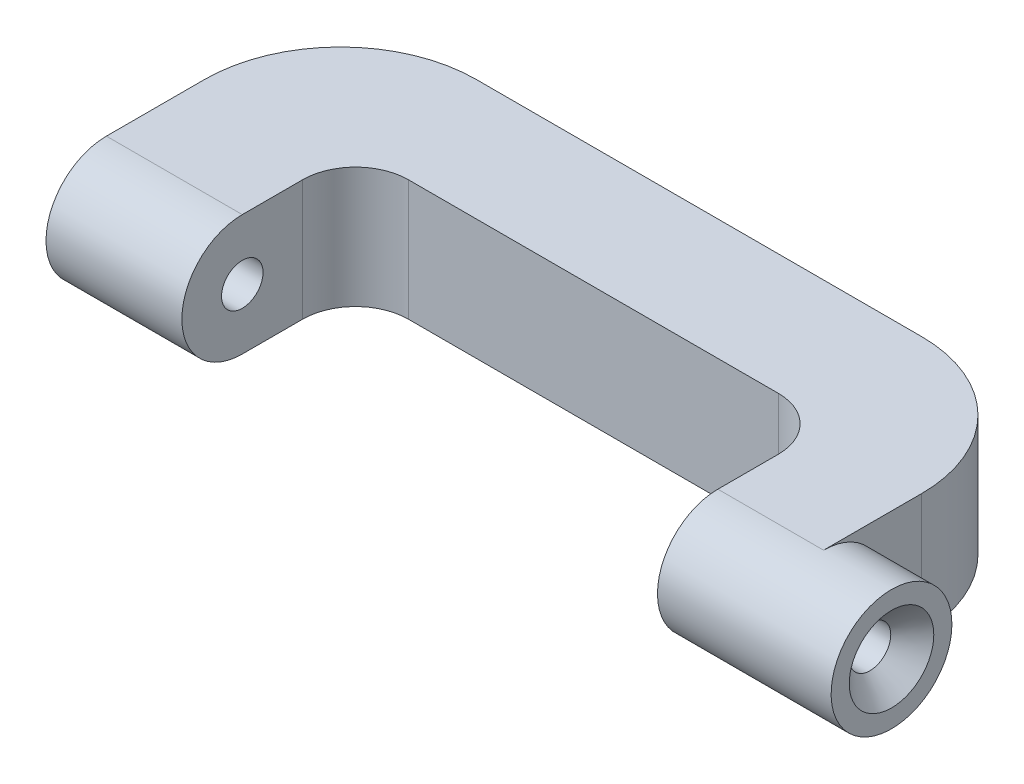
ISO-10303-21;
HEADER;
FILE_DESCRIPTION(('STEP AP214'),'2;1');
FILE_NAME('part.step','',(''),(''),'','','');
FILE_SCHEMA(('AUTOMOTIVE_DESIGN { 1 0 10303 214 1 1 1 1 }'));
ENDSEC;
DATA;
#1=APPLICATION_CONTEXT('core data for automotive mechanical design processes');
#2=APPLICATION_PROTOCOL_DEFINITION('international standard','automotive_design',2000,#1);
#3=PRODUCT_CONTEXT('',#1,'mechanical');
#4=PRODUCT('Part','Part','',(#3));
#5=PRODUCT_RELATED_PRODUCT_CATEGORY('part','',(#4));
#6=PRODUCT_DEFINITION_FORMATION('','',#4);
#7=PRODUCT_DEFINITION_CONTEXT('part definition',#1,'design');
#8=PRODUCT_DEFINITION('design','',#6,#7);
#9=PRODUCT_DEFINITION_SHAPE('','',#8);
#10=(LENGTH_UNIT() NAMED_UNIT(*) SI_UNIT(.MILLI.,.METRE.));
#11=(NAMED_UNIT(*) PLANE_ANGLE_UNIT() SI_UNIT($,.RADIAN.));
#12=(NAMED_UNIT(*) SI_UNIT($,.STERADIAN.) SOLID_ANGLE_UNIT());
#13=UNCERTAINTY_MEASURE_WITH_UNIT(LENGTH_MEASURE(1.E-05),#10,'distance_accuracy_value','');
#14=(GEOMETRIC_REPRESENTATION_CONTEXT(3) GLOBAL_UNCERTAINTY_ASSIGNED_CONTEXT((#13)) GLOBAL_UNIT_ASSIGNED_CONTEXT((#10,
#11,#12)) REPRESENTATION_CONTEXT('',''));
#15=CARTESIAN_POINT('',(0.,0.,0.));
#16=DIRECTION('',(0.,0.,1.));
#17=DIRECTION('',(1.,0.,0.));
#18=AXIS2_PLACEMENT_3D('',#15,#16,#17);
#19=CARTESIAN_POINT('',(18.,0.,0.));
#20=DIRECTION('',(-1.,0.,0.));
#21=DIRECTION('',(0.,0.,1.));
#22=AXIS2_PLACEMENT_3D('',#19,#20,#21);
#23=CYLINDRICAL_SURFACE('',#22,8.);
#24=CARTESIAN_POINT('',(18.,0.,0.));
#25=DIRECTION('',(1.,0.,0.));
#26=DIRECTION('',(0.,0.,-1.));
#27=AXIS2_PLACEMENT_3D('',#24,#25,#26);
#28=CIRCLE('',#27,8.);
#29=CARTESIAN_POINT('',(18.,8.,0.));
#30=VERTEX_POINT('',#29);
#31=CARTESIAN_POINT('',(18.,-8.,0.));
#32=VERTEX_POINT('',#31);
#33=EDGE_CURVE('E11',#30,#32,#28,.T.);
#34=ORIENTED_EDGE('',*,*,#33,.F.);
#35=DIRECTION('',(1.,0.,0.));
#36=VECTOR('',#35,1.);
#37=CARTESIAN_POINT('',(18.,8.,0.));
#38=LINE('',#37,#36);
#39=CARTESIAN_POINT('',(0.,8.,0.));
#40=VERTEX_POINT('',#39);
#41=EDGE_CURVE('E166',#40,#30,#38,.T.);
#42=ORIENTED_EDGE('',*,*,#41,.F.);
#43=CARTESIAN_POINT('',(0.,0.,0.));
#44=DIRECTION('',(1.,0.,0.));
#45=DIRECTION('',(0.,0.,-1.));
#46=AXIS2_PLACEMENT_3D('',#43,#44,#45);
#47=CIRCLE('',#46,8.);
#48=CARTESIAN_POINT('',(0.,-8.,0.));
#49=VERTEX_POINT('',#48);
#50=EDGE_CURVE('E46',#40,#49,#47,.T.);
#51=ORIENTED_EDGE('',*,*,#50,.T.);
#52=DIRECTION('',(1.,0.,0.));
#53=VECTOR('',#52,1.);
#54=CARTESIAN_POINT('',(18.,-8.,0.));
#55=LINE('',#54,#53);
#56=EDGE_CURVE('E57',#49,#32,#55,.T.);
#57=ORIENTED_EDGE('',*,*,#56,.T.);
#58=EDGE_LOOP('',(#34,#42,#51,#57));
#59=FACE_BOUND('',#58,.T.);
#60=ADVANCED_FACE('F43',(#59),#23,.T.);
#61=CARTESIAN_POINT('',(18.,0.,0.));
#62=DIRECTION('',(1.,0.,0.));
#63=DIRECTION('',(0.,0.,-1.));
#64=AXIS2_PLACEMENT_3D('',#61,#62,#63);
#65=PLANE('',#64);
#66=CARTESIAN_POINT('',(18.,0.,0.));
#67=DIRECTION('',(1.,0.,0.));
#68=DIRECTION('',(0.,0.,-1.));
#69=AXIS2_PLACEMENT_3D('',#66,#67,#68);
#70=CIRCLE('',#69,2.74999999999999);
#71=CARTESIAN_POINT('',(18.,0.,-2.74999999999999));
#72=VERTEX_POINT('',#71);
#73=EDGE_CURVE('E272',#72,#72,#70,.T.);
#74=ORIENTED_EDGE('',*,*,#73,.F.);
#75=EDGE_LOOP('',(#74));
#76=FACE_BOUND('',#75,.T.);
#77=DIRECTION('',(0.,0.,-1.));
#78=VECTOR('',#77,1.);
#79=CARTESIAN_POINT('',(18.,-8.,-7.99999999999996));
#80=LINE('',#79,#78);
#81=CARTESIAN_POINT('',(18.,-8.,-7.99999999999996));
#82=VERTEX_POINT('',#81);
#83=EDGE_CURVE('E203',#32,#82,#80,.T.);
#84=ORIENTED_EDGE('',*,*,#83,.T.);
#85=DIRECTION('',(0.,-1.,0.));
#86=VECTOR('',#85,1.);
#87=CARTESIAN_POINT('',(18.,8.,-7.99999999999996));
#88=LINE('',#87,#86);
#89=CARTESIAN_POINT('',(18.,8.,-7.99999999999996));
#90=VERTEX_POINT('',#89);
#91=EDGE_CURVE('E187',#90,#82,#88,.T.);
#92=ORIENTED_EDGE('',*,*,#91,.F.);
#93=DIRECTION('',(0.,0.,-1.));
#94=VECTOR('',#93,1.);
#95=CARTESIAN_POINT('',(18.,8.,-7.99999999999996));
#96=LINE('',#95,#94);
#97=EDGE_CURVE('E240',#30,#90,#96,.T.);
#98=ORIENTED_EDGE('',*,*,#97,.F.);
#99=ORIENTED_EDGE('',*,*,#33,.T.);
#100=EDGE_LOOP('',(#84,#92,#98,#99));
#101=FACE_BOUND('',#100,.T.);
#102=ADVANCED_FACE('F259',(#76,#101),#65,.T.);
#103=CARTESIAN_POINT('',(0.,0.,0.));
#104=DIRECTION('',(1.,0.,0.));
#105=DIRECTION('',(0.,0.,-1.));
#106=AXIS2_PLACEMENT_3D('',#103,#104,#105);
#107=PLANE('',#106);
#108=CARTESIAN_POINT('',(0.,0.,0.));
#109=DIRECTION('',(1.,0.,0.));
#110=DIRECTION('',(0.,0.,-1.));
#111=AXIS2_PLACEMENT_3D('',#108,#109,#110);
#112=CIRCLE('',#111,2.74999999999998);
#113=CARTESIAN_POINT('',(0.,0.,-2.74999999999998));
#114=VERTEX_POINT('',#113);
#115=EDGE_CURVE('E277',#114,#114,#112,.T.);
#116=ORIENTED_EDGE('',*,*,#115,.T.);
#117=EDGE_LOOP('',(#116));
#118=FACE_BOUND('',#117,.T.);
#119=ORIENTED_EDGE('',*,*,#50,.F.);
#120=DIRECTION('',(0.,0.,1.));
#121=VECTOR('',#120,1.);
#122=CARTESIAN_POINT('',(0.,8.,0.));
#123=LINE('',#122,#121);
#124=CARTESIAN_POINT('',(0.,8.,-12.9999999999999));
#125=VERTEX_POINT('',#124);
#126=EDGE_CURVE('E171',#125,#40,#123,.T.);
#127=ORIENTED_EDGE('',*,*,#126,.F.);
#128=DIRECTION('',(0.,-1.,0.));
#129=VECTOR('',#128,1.);
#130=CARTESIAN_POINT('',(0.,8.,-12.9999999999999));
#131=LINE('',#130,#129);
#132=CARTESIAN_POINT('',(0.,-8.,-12.9999999999999));
#133=VERTEX_POINT('',#132);
#134=EDGE_CURVE('E167',#125,#133,#131,.T.);
#135=ORIENTED_EDGE('',*,*,#134,.T.);
#136=DIRECTION('',(0.,0.,1.));
#137=VECTOR('',#136,1.);
#138=CARTESIAN_POINT('',(0.,-8.,0.));
#139=LINE('',#138,#137);
#140=EDGE_CURVE('E163',#133,#49,#139,.T.);
#141=ORIENTED_EDGE('',*,*,#140,.T.);
#142=EDGE_LOOP('',(#119,#127,#135,#141));
#143=FACE_BOUND('',#142,.T.);
#144=ADVANCED_FACE('F198',(#118,#143),#107,.F.);
#145=CARTESIAN_POINT('',(25.,8.,-8.00000000000001));
#146=DIRECTION('',(0.,-1.,0.));
#147=DIRECTION('',(0.,0.,-1.));
#148=AXIS2_PLACEMENT_3D('',#145,#146,#147);
#149=CYLINDRICAL_SURFACE('',#148,7.);
#150=CARTESIAN_POINT('',(25.,-8.,-8.00000000000001));
#151=DIRECTION('',(0.,-1.,0.));
#152=DIRECTION('',(0.,0.,1.));
#153=AXIS2_PLACEMENT_3D('',#150,#151,#152);
#154=CIRCLE('',#153,7.);
#155=CARTESIAN_POINT('',(25.,-8.,-15.));
#156=VERTEX_POINT('',#155);
#157=EDGE_CURVE('E205',#82,#156,#154,.T.);
#158=ORIENTED_EDGE('',*,*,#157,.T.);
#159=DIRECTION('',(0.,-1.,0.));
#160=VECTOR('',#159,1.);
#161=CARTESIAN_POINT('',(25.,8.,-15.));
#162=LINE('',#161,#160);
#163=CARTESIAN_POINT('',(25.,8.,-15.));
#164=VERTEX_POINT('',#163);
#165=EDGE_CURVE('E184',#164,#156,#162,.T.);
#166=ORIENTED_EDGE('',*,*,#165,.F.);
#167=CARTESIAN_POINT('',(25.,8.,-8.00000000000001));
#168=DIRECTION('',(0.,-1.,0.));
#169=DIRECTION('',(0.,0.,1.));
#170=AXIS2_PLACEMENT_3D('',#167,#168,#169);
#171=CIRCLE('',#170,7.);
#172=EDGE_CURVE('E242',#90,#164,#171,.T.);
#173=ORIENTED_EDGE('',*,*,#172,.F.);
#174=ORIENTED_EDGE('',*,*,#91,.T.);
#175=EDGE_LOOP('',(#158,#166,#173,#174));
#176=FACE_BOUND('',#175,.T.);
#177=ADVANCED_FACE('F250',(#176),#149,.F.);
#178=CARTESIAN_POINT('',(74.,8.,-15.));
#179=DIRECTION('',(0.,0.,-1.));
#180=DIRECTION('',(-1.,0.,0.));
#181=AXIS2_PLACEMENT_3D('',#178,#179,#180);
#182=PLANE('',#181);
#183=DIRECTION('',(1.,0.,0.));
#184=VECTOR('',#183,1.);
#185=CARTESIAN_POINT('',(74.,-8.,-15.));
#186=LINE('',#185,#184);
#187=CARTESIAN_POINT('',(74.,-8.,-15.));
#188=VERTEX_POINT('',#187);
#189=EDGE_CURVE('E211',#156,#188,#186,.T.);
#190=ORIENTED_EDGE('',*,*,#189,.T.);
#191=DIRECTION('',(0.,-1.,0.));
#192=VECTOR('',#191,1.);
#193=CARTESIAN_POINT('',(74.,8.,-15.));
#194=LINE('',#193,#192);
#195=CARTESIAN_POINT('',(74.,8.,-15.));
#196=VERTEX_POINT('',#195);
#197=EDGE_CURVE('E181',#196,#188,#194,.T.);
#198=ORIENTED_EDGE('',*,*,#197,.F.);
#199=DIRECTION('',(1.,0.,0.));
#200=VECTOR('',#199,1.);
#201=CARTESIAN_POINT('',(74.,8.,-15.));
#202=LINE('',#201,#200);
#203=EDGE_CURVE('E229',#164,#196,#202,.T.);
#204=ORIENTED_EDGE('',*,*,#203,.F.);
#205=ORIENTED_EDGE('',*,*,#165,.T.);
#206=EDGE_LOOP('',(#190,#198,#204,#205));
#207=FACE_BOUND('',#206,.T.);
#208=ADVANCED_FACE('F249',(#207),#182,.F.);
#209=CARTESIAN_POINT('',(74.,8.,-8.00000000000001));
#210=DIRECTION('',(0.,-1.,0.));
#211=DIRECTION('',(0.,0.,-1.));
#212=AXIS2_PLACEMENT_3D('',#209,#210,#211);
#213=CYLINDRICAL_SURFACE('',#212,7.);
#214=CARTESIAN_POINT('',(74.,-8.,-8.00000000000001));
#215=DIRECTION('',(0.,-1.,0.));
#216=DIRECTION('',(0.,0.,1.));
#217=AXIS2_PLACEMENT_3D('',#214,#215,#216);
#218=CIRCLE('',#217,7.);
#219=CARTESIAN_POINT('',(81.,-8.,-7.99999999999996));
#220=VERTEX_POINT('',#219);
#221=EDGE_CURVE('E154',#188,#220,#218,.T.);
#222=ORIENTED_EDGE('',*,*,#221,.T.);
#223=DIRECTION('',(0.,-1.,0.));
#224=VECTOR('',#223,1.);
#225=CARTESIAN_POINT('',(81.,8.,-7.99999999999996));
#226=LINE('',#225,#224);
#227=CARTESIAN_POINT('',(81.,8.,-7.99999999999996));
#228=VERTEX_POINT('',#227);
#229=EDGE_CURVE('E179',#228,#220,#226,.T.);
#230=ORIENTED_EDGE('',*,*,#229,.F.);
#231=CARTESIAN_POINT('',(74.,8.,-8.00000000000001));
#232=DIRECTION('',(0.,-1.,0.));
#233=DIRECTION('',(0.,0.,1.));
#234=AXIS2_PLACEMENT_3D('',#231,#232,#233);
#235=CIRCLE('',#234,7.);
#236=EDGE_CURVE('E226',#196,#228,#235,.T.);
#237=ORIENTED_EDGE('',*,*,#236,.F.);
#238=ORIENTED_EDGE('',*,*,#197,.T.);
#239=EDGE_LOOP('',(#222,#230,#237,#238));
#240=FACE_BOUND('',#239,.T.);
#241=ADVANCED_FACE('F216',(#240),#213,.F.);
#242=CARTESIAN_POINT('',(81.,8.,0.));
#243=DIRECTION('',(1.,0.,0.));
#244=DIRECTION('',(0.,0.,-1.));
#245=AXIS2_PLACEMENT_3D('',#242,#243,#244);
#246=PLANE('',#245);
#247=CARTESIAN_POINT('',(81.,0.,0.));
#248=DIRECTION('',(1.,0.,0.));
#249=DIRECTION('',(0.,0.,-1.));
#250=AXIS2_PLACEMENT_3D('',#247,#248,#249);
#251=CIRCLE('',#250,2.74999999999999);
#252=CARTESIAN_POINT('',(81.,0.,-2.74999999999999));
#253=VERTEX_POINT('',#252);
#254=EDGE_CURVE('E274',#253,#253,#251,.T.);
#255=ORIENTED_EDGE('',*,*,#254,.T.);
#256=EDGE_LOOP('',(#255));
#257=FACE_BOUND('',#256,.T.);
#258=ORIENTED_EDGE('',*,*,#229,.T.);
#259=DIRECTION('',(0.,0.,1.));
#260=VECTOR('',#259,1.);
#261=CARTESIAN_POINT('',(81.,-8.,0.));
#262=LINE('',#261,#260);
#263=CARTESIAN_POINT('',(81.,-8.,0.));
#264=VERTEX_POINT('',#263);
#265=EDGE_CURVE('E152',#220,#264,#262,.T.);
#266=ORIENTED_EDGE('',*,*,#265,.T.);
#267=CARTESIAN_POINT('',(81.,0.,0.));
#268=DIRECTION('',(1.,0.,0.));
#269=DIRECTION('',(0.,0.,-1.));
#270=AXIS2_PLACEMENT_3D('',#267,#268,#269);
#271=CIRCLE('',#270,8.);
#272=CARTESIAN_POINT('',(81.,8.,0.));
#273=VERTEX_POINT('',#272);
#274=EDGE_CURVE('E151',#273,#264,#271,.T.);
#275=ORIENTED_EDGE('',*,*,#274,.F.);
#276=DIRECTION('',(0.,0.,1.));
#277=VECTOR('',#276,1.);
#278=CARTESIAN_POINT('',(81.,8.,0.));
#279=LINE('',#278,#277);
#280=EDGE_CURVE('E223',#228,#273,#279,.T.);
#281=ORIENTED_EDGE('',*,*,#280,.F.);
#282=EDGE_LOOP('',(#258,#266,#275,#281));
#283=FACE_BOUND('',#282,.T.);
#284=ADVANCED_FACE('F222',(#257,#283),#246,.F.);
#285=CARTESIAN_POINT('',(95.,8.,-12.9999999999999));
#286=DIRECTION('',(-1.,0.,0.));
#287=DIRECTION('',(0.,0.,1.));
#288=AXIS2_PLACEMENT_3D('',#285,#286,#287);
#289=PLANE('',#288);
#290=CARTESIAN_POINT('',(95.,0.,0.));
#291=DIRECTION('',(-1.,0.,0.));
#292=DIRECTION('',(0.,0.,1.));
#293=AXIS2_PLACEMENT_3D('',#290,#291,#292);
#294=CIRCLE('',#293,8.);
#295=CARTESIAN_POINT('',(95.,-8.,0.));
#296=VERTEX_POINT('',#295);
#297=CARTESIAN_POINT('',(95.,8.,0.));
#298=VERTEX_POINT('',#297);
#299=EDGE_CURVE('E142',#296,#298,#294,.F.);
#300=ORIENTED_EDGE('',*,*,#299,.F.);
#301=DIRECTION('',(0.,0.,-1.));
#302=VECTOR('',#301,1.);
#303=CARTESIAN_POINT('',(95.,-8.,-12.9999999999999));
#304=LINE('',#303,#302);
#305=CARTESIAN_POINT('',(95.,-8.,-12.9999999999999));
#306=VERTEX_POINT('',#305);
#307=EDGE_CURVE('E127',#296,#306,#304,.T.);
#308=ORIENTED_EDGE('',*,*,#307,.T.);
#309=DIRECTION('',(0.,-1.,0.));
#310=VECTOR('',#309,1.);
#311=CARTESIAN_POINT('',(95.,8.,-12.9999999999999));
#312=LINE('',#311,#310);
#313=CARTESIAN_POINT('',(95.,8.,-12.9999999999999));
#314=VERTEX_POINT('',#313);
#315=EDGE_CURVE('E177',#314,#306,#312,.T.);
#316=ORIENTED_EDGE('',*,*,#315,.F.);
#317=DIRECTION('',(0.,0.,-1.));
#318=VECTOR('',#317,1.);
#319=CARTESIAN_POINT('',(95.,8.,-12.9999999999999));
#320=LINE('',#319,#318);
#321=EDGE_CURVE('E144',#298,#314,#320,.T.);
#322=ORIENTED_EDGE('',*,*,#321,.F.);
#323=EDGE_LOOP('',(#300,#308,#316,#322));
#324=FACE_BOUND('',#323,.T.);
#325=ADVANCED_FACE('F143',(#324),#289,.F.);
#326=CARTESIAN_POINT('',(77.,8.,-13.));
#327=DIRECTION('',(0.,-1.,0.));
#328=DIRECTION('',(0.,0.,-1.));
#329=AXIS2_PLACEMENT_3D('',#326,#327,#328);
#330=CYLINDRICAL_SURFACE('',#329,18.);
#331=CARTESIAN_POINT('',(77.,-8.,-13.));
#332=DIRECTION('',(0.,1.,0.));
#333=DIRECTION('',(0.,0.,-1.));
#334=AXIS2_PLACEMENT_3D('',#331,#332,#333);
#335=CIRCLE('',#334,18.);
#336=CARTESIAN_POINT('',(76.9999999999999,-8.,-31.));
#337=VERTEX_POINT('',#336);
#338=EDGE_CURVE('E135',#306,#337,#335,.T.);
#339=ORIENTED_EDGE('',*,*,#338,.T.);
#340=DIRECTION('',(0.,-1.,0.));
#341=VECTOR('',#340,1.);
#342=CARTESIAN_POINT('',(76.9999999999999,8.,-31.));
#343=LINE('',#342,#341);
#344=CARTESIAN_POINT('',(76.9999999999999,8.,-31.));
#345=VERTEX_POINT('',#344);
#346=EDGE_CURVE('E174',#345,#337,#343,.T.);
#347=ORIENTED_EDGE('',*,*,#346,.F.);
#348=CARTESIAN_POINT('',(77.,8.,-13.));
#349=DIRECTION('',(0.,1.,0.));
#350=DIRECTION('',(0.,0.,-1.));
#351=AXIS2_PLACEMENT_3D('',#348,#349,#350);
#352=CIRCLE('',#351,18.);
#353=EDGE_CURVE('E234',#314,#345,#352,.T.);
#354=ORIENTED_EDGE('',*,*,#353,.F.);
#355=ORIENTED_EDGE('',*,*,#315,.T.);
#356=EDGE_LOOP('',(#339,#347,#354,#355));
#357=FACE_BOUND('',#356,.T.);
#358=ADVANCED_FACE('F306',(#357),#330,.T.);
#359=CARTESIAN_POINT('',(18.0000000000001,8.,-31.));
#360=DIRECTION('',(0.,0.,1.));
#361=DIRECTION('',(1.,0.,0.));
#362=AXIS2_PLACEMENT_3D('',#359,#360,#361);
#363=PLANE('',#362);
#364=DIRECTION('',(-1.,0.,0.));
#365=VECTOR('',#364,1.);
#366=CARTESIAN_POINT('',(18.0000000000001,-8.,-31.));
#367=LINE('',#366,#365);
#368=CARTESIAN_POINT('',(18.,-8.,-31.));
#369=VERTEX_POINT('',#368);
#370=EDGE_CURVE('E159',#337,#369,#367,.T.);
#371=ORIENTED_EDGE('',*,*,#370,.T.);
#372=DIRECTION('',(0.,-1.,0.));
#373=VECTOR('',#372,1.);
#374=CARTESIAN_POINT('',(18.,8.,-31.));
#375=LINE('',#374,#373);
#376=CARTESIAN_POINT('',(18.,8.,-31.));
#377=VERTEX_POINT('',#376);
#378=EDGE_CURVE('E170',#377,#369,#375,.T.);
#379=ORIENTED_EDGE('',*,*,#378,.F.);
#380=DIRECTION('',(-1.,0.,0.));
#381=VECTOR('',#380,1.);
#382=CARTESIAN_POINT('',(18.0000000000001,8.,-31.));
#383=LINE('',#382,#381);
#384=EDGE_CURVE('E236',#345,#377,#383,.T.);
#385=ORIENTED_EDGE('',*,*,#384,.F.);
#386=ORIENTED_EDGE('',*,*,#346,.T.);
#387=EDGE_LOOP('',(#371,#379,#385,#386));
#388=FACE_BOUND('',#387,.T.);
#389=ADVANCED_FACE('F302',(#388),#363,.F.);
#390=CARTESIAN_POINT('',(18.,8.,-13.));
#391=DIRECTION('',(0.,-1.,0.));
#392=DIRECTION('',(0.,0.,-1.));
#393=AXIS2_PLACEMENT_3D('',#390,#391,#392);
#394=CYLINDRICAL_SURFACE('',#393,18.);
#395=CARTESIAN_POINT('',(18.,-8.,-13.));
#396=DIRECTION('',(0.,1.,0.));
#397=DIRECTION('',(0.,0.,-1.));
#398=AXIS2_PLACEMENT_3D('',#395,#396,#397);
#399=CIRCLE('',#398,18.);
#400=EDGE_CURVE('E161',#369,#133,#399,.T.);
#401=ORIENTED_EDGE('',*,*,#400,.T.);
#402=ORIENTED_EDGE('',*,*,#134,.F.);
#403=CARTESIAN_POINT('',(18.,8.,-13.));
#404=DIRECTION('',(0.,1.,0.));
#405=DIRECTION('',(0.,0.,-1.));
#406=AXIS2_PLACEMENT_3D('',#403,#404,#405);
#407=CIRCLE('',#406,18.);
#408=EDGE_CURVE('E237',#377,#125,#407,.T.);
#409=ORIENTED_EDGE('',*,*,#408,.F.);
#410=ORIENTED_EDGE('',*,*,#378,.T.);
#411=EDGE_LOOP('',(#401,#402,#409,#410));
#412=FACE_BOUND('',#411,.T.);
#413=ADVANCED_FACE('F298',(#412),#394,.T.);
#414=CARTESIAN_POINT('',(18.,8.,-13.));
#415=DIRECTION('',(0.,-1.,0.));
#416=DIRECTION('',(0.,0.,-1.));
#417=AXIS2_PLACEMENT_3D('',#414,#415,#416);
#418=PLANE('',#417);
#419=ORIENTED_EDGE('',*,*,#41,.T.);
#420=ORIENTED_EDGE('',*,*,#97,.T.);
#421=ORIENTED_EDGE('',*,*,#172,.T.);
#422=ORIENTED_EDGE('',*,*,#203,.T.);
#423=ORIENTED_EDGE('',*,*,#236,.T.);
#424=ORIENTED_EDGE('',*,*,#280,.T.);
#425=DIRECTION('',(1.,0.,0.));
#426=VECTOR('',#425,1.);
#427=CARTESIAN_POINT('',(95.,8.,0.));
#428=LINE('',#427,#426);
#429=EDGE_CURVE('E225',#273,#298,#428,.T.);
#430=ORIENTED_EDGE('',*,*,#429,.T.);
#431=ORIENTED_EDGE('',*,*,#321,.T.);
#432=ORIENTED_EDGE('',*,*,#353,.T.);
#433=ORIENTED_EDGE('',*,*,#384,.T.);
#434=ORIENTED_EDGE('',*,*,#408,.T.);
#435=ORIENTED_EDGE('',*,*,#126,.T.);
#436=EDGE_LOOP('',(#419,#420,#421,#422,#423,#424,#430,#431,#432,#433,#434,#435));
#437=FACE_BOUND('',#436,.T.);
#438=ADVANCED_FACE('F239',(#437),#418,.F.);
#439=CARTESIAN_POINT('',(18.,-8.,-13.));
#440=DIRECTION('',(0.,-1.,0.));
#441=DIRECTION('',(0.,0.,-1.));
#442=AXIS2_PLACEMENT_3D('',#439,#440,#441);
#443=PLANE('',#442);
#444=ORIENTED_EDGE('',*,*,#56,.F.);
#445=ORIENTED_EDGE('',*,*,#140,.F.);
#446=ORIENTED_EDGE('',*,*,#400,.F.);
#447=ORIENTED_EDGE('',*,*,#370,.F.);
#448=ORIENTED_EDGE('',*,*,#338,.F.);
#449=ORIENTED_EDGE('',*,*,#307,.F.);
#450=DIRECTION('',(1.,0.,0.));
#451=VECTOR('',#450,1.);
#452=CARTESIAN_POINT('',(95.,-8.,0.));
#453=LINE('',#452,#451);
#454=EDGE_CURVE('E132',#264,#296,#453,.T.);
#455=ORIENTED_EDGE('',*,*,#454,.F.);
#456=ORIENTED_EDGE('',*,*,#265,.F.);
#457=ORIENTED_EDGE('',*,*,#221,.F.);
#458=ORIENTED_EDGE('',*,*,#189,.F.);
#459=ORIENTED_EDGE('',*,*,#157,.F.);
#460=ORIENTED_EDGE('',*,*,#83,.F.);
#461=EDGE_LOOP('',(#444,#445,#446,#447,#448,#449,#455,#456,#457,#458,#459,#460));
#462=FACE_BOUND('',#461,.T.);
#463=ADVANCED_FACE('F129',(#462),#443,.T.);
#464=CARTESIAN_POINT('',(104.,0.,0.));
#465=DIRECTION('',(-1.,0.,0.));
#466=DIRECTION('',(0.,0.,1.));
#467=AXIS2_PLACEMENT_3D('',#464,#465,#466);
#468=CYLINDRICAL_SURFACE('',#467,8.);
#469=CARTESIAN_POINT('',(104.,0.,0.));
#470=DIRECTION('',(1.,0.,0.));
#471=DIRECTION('',(0.,0.,-1.));
#472=AXIS2_PLACEMENT_3D('',#469,#470,#471);
#473=CIRCLE('',#472,8.);
#474=CARTESIAN_POINT('',(104.,0.,-8.));
#475=VERTEX_POINT('',#474);
#476=EDGE_CURVE('E147',#475,#475,#473,.T.);
#477=ORIENTED_EDGE('',*,*,#476,.F.);
#478=EDGE_LOOP('',(#477));
#479=FACE_BOUND('',#478,.T.);
#480=ORIENTED_EDGE('',*,*,#299,.T.);
#481=ORIENTED_EDGE('',*,*,#429,.F.);
#482=ORIENTED_EDGE('',*,*,#274,.T.);
#483=ORIENTED_EDGE('',*,*,#454,.T.);
#484=EDGE_LOOP('',(#480,#481,#482,#483));
#485=FACE_BOUND('',#484,.T.);
#486=ADVANCED_FACE('F149',(#479,#485),#468,.T.);
#487=CARTESIAN_POINT('',(104.,0.,0.));
#488=DIRECTION('',(1.,0.,0.));
#489=DIRECTION('',(0.,0.,-1.));
#490=AXIS2_PLACEMENT_3D('',#487,#488,#489);
#491=PLANE('',#490);
#492=CARTESIAN_POINT('',(104.,0.,0.));
#493=DIRECTION('',(1.,0.,0.));
#494=DIRECTION('',(0.,0.,-1.));
#495=AXIS2_PLACEMENT_3D('',#492,#493,#494);
#496=CIRCLE('',#495,5.6);
#497=CARTESIAN_POINT('',(104.,0.,-5.6));
#498=VERTEX_POINT('',#497);
#499=EDGE_CURVE('E387',#498,#498,#496,.T.);
#500=ORIENTED_EDGE('',*,*,#499,.F.);
#501=EDGE_LOOP('',(#500));
#502=FACE_BOUND('',#501,.T.);
#503=ORIENTED_EDGE('',*,*,#476,.T.);
#504=EDGE_LOOP('',(#503));
#505=FACE_BOUND('',#504,.T.);
#506=ADVANCED_FACE('F284',(#502,#505),#491,.T.);
#507=CARTESIAN_POINT('',(104.,0.,0.));
#508=DIRECTION('',(1.,0.,0.));
#509=DIRECTION('',(0.,0.,-1.));
#510=AXIS2_PLACEMENT_3D('',#507,#508,#509);
#511=CONICAL_SURFACE('',#510,5.6,0.785398163397446);
#512=CARTESIAN_POINT('',(101.15,0.,0.));
#513=DIRECTION('',(1.,0.,0.));
#514=DIRECTION('',(0.,0.,-1.));
#515=AXIS2_PLACEMENT_3D('',#512,#513,#514);
#516=CIRCLE('',#515,2.74999999999999);
#517=CARTESIAN_POINT('',(101.15,0.,-2.74999999999999));
#518=VERTEX_POINT('',#517);
#519=EDGE_CURVE('E385',#518,#518,#516,.T.);
#520=ORIENTED_EDGE('',*,*,#519,.F.);
#521=EDGE_LOOP('',(#520));
#522=FACE_BOUND('',#521,.T.);
#523=ORIENTED_EDGE('',*,*,#499,.T.);
#524=EDGE_LOOP('',(#523));
#525=FACE_BOUND('',#524,.T.);
#526=ADVANCED_FACE('F291',(#522,#525),#511,.F.);
#527=CARTESIAN_POINT('',(104.,0.,0.));
#528=DIRECTION('',(1.,0.,0.));
#529=DIRECTION('',(0.,0.,-1.));
#530=AXIS2_PLACEMENT_3D('',#527,#528,#529);
#531=CYLINDRICAL_SURFACE('',#530,2.74999999999999);
#532=ORIENTED_EDGE('',*,*,#519,.T.);
#533=EDGE_LOOP('',(#532));
#534=FACE_BOUND('',#533,.T.);
#535=ORIENTED_EDGE('',*,*,#254,.F.);
#536=EDGE_LOOP('',(#535));
#537=FACE_BOUND('',#536,.T.);
#538=ADVANCED_FACE('F362',(#534,#537),#531,.F.);
#539=ORIENTED_EDGE('',*,*,#73,.T.);
#540=EDGE_LOOP('',(#539));
#541=FACE_BOUND('',#540,.T.);
#542=ORIENTED_EDGE('',*,*,#115,.F.);
#543=EDGE_LOOP('',(#542));
#544=FACE_BOUND('',#543,.T.);
#545=ADVANCED_FACE('F372',(#541,#544),#531,.F.);
#546=CLOSED_SHELL('',(#60,#102,#144,#177,#208,#241,#284,#325,#358,#389,#413,#438,#463,#486,#506,
#526,#538,#545));
#547=MANIFOLD_SOLID_BREP('B2',#546);
#548=ADVANCED_BREP_SHAPE_REPRESENTATION('',(#18,#547),#14);
#549=SHAPE_DEFINITION_REPRESENTATION(#9,#548);
ENDSEC;
END-ISO-10303-21;
